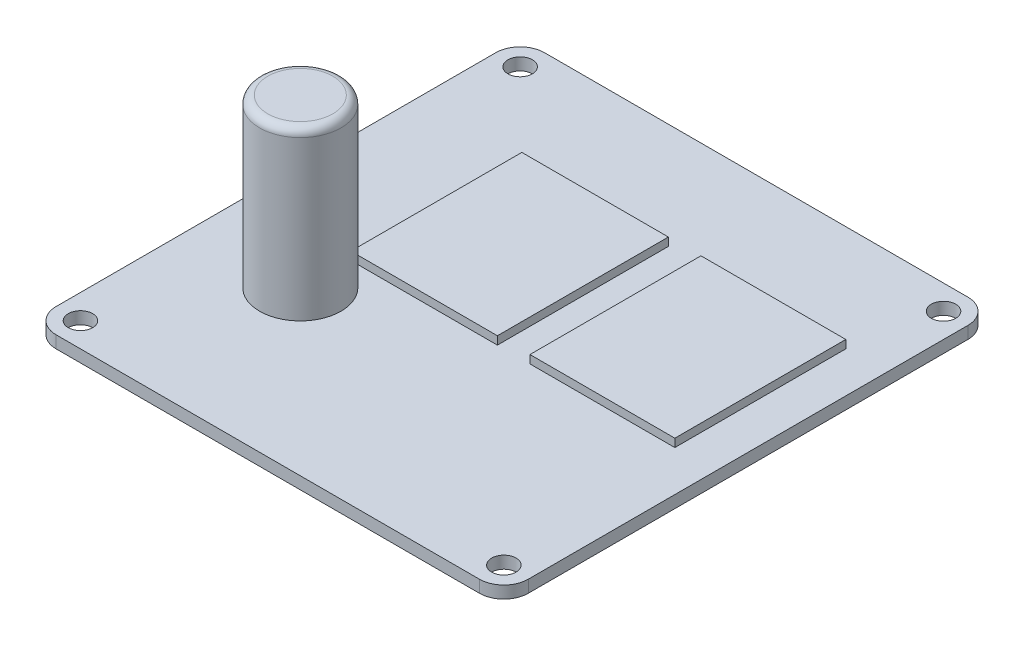
ISO-10303-21;
HEADER;
FILE_DESCRIPTION(('STEP AP214'),'2;1');
FILE_NAME('part.step','',(''),(''),'','','');
FILE_SCHEMA(('AUTOMOTIVE_DESIGN { 1 0 10303 214 1 1 1 1 }'));
ENDSEC;
DATA;
#1=APPLICATION_CONTEXT('core data for automotive mechanical design processes');
#2=APPLICATION_PROTOCOL_DEFINITION('international standard','automotive_design',2000,#1);
#3=PRODUCT_CONTEXT('',#1,'mechanical');
#4=PRODUCT('Part','Part','',(#3));
#5=PRODUCT_RELATED_PRODUCT_CATEGORY('part','',(#4));
#6=PRODUCT_DEFINITION_FORMATION('','',#4);
#7=PRODUCT_DEFINITION_CONTEXT('part definition',#1,'design');
#8=PRODUCT_DEFINITION('design','',#6,#7);
#9=PRODUCT_DEFINITION_SHAPE('','',#8);
#10=(LENGTH_UNIT() NAMED_UNIT(*) SI_UNIT(.MILLI.,.METRE.));
#11=(NAMED_UNIT(*) PLANE_ANGLE_UNIT() SI_UNIT($,.RADIAN.));
#12=(NAMED_UNIT(*) SI_UNIT($,.STERADIAN.) SOLID_ANGLE_UNIT());
#13=UNCERTAINTY_MEASURE_WITH_UNIT(LENGTH_MEASURE(1.E-05),#10,'distance_accuracy_value','');
#14=(GEOMETRIC_REPRESENTATION_CONTEXT(3) GLOBAL_UNCERTAINTY_ASSIGNED_CONTEXT((#13)) GLOBAL_UNIT_ASSIGNED_CONTEXT((#10,
#11,#12)) REPRESENTATION_CONTEXT('',''));
#15=CARTESIAN_POINT('',(0.,0.,0.));
#16=DIRECTION('',(0.,0.,1.));
#17=DIRECTION('',(1.,0.,0.));
#18=AXIS2_PLACEMENT_3D('',#15,#16,#17);
#19=CARTESIAN_POINT('',(-26.,0.,-27.));
#20=DIRECTION('',(0.,1.,0.));
#21=DIRECTION('',(0.,0.,1.));
#22=AXIS2_PLACEMENT_3D('',#19,#20,#21);
#23=PLANE('',#22);
#24=CARTESIAN_POINT('',(26.,0.,-27.));
#25=DIRECTION('',(0.,1.,0.));
#26=DIRECTION('',(0.,0.,-1.));
#27=AXIS2_PLACEMENT_3D('',#24,#25,#26);
#28=CIRCLE('',#27,1.5);
#29=CARTESIAN_POINT('',(26.,0.,-28.5));
#30=VERTEX_POINT('',#29);
#31=EDGE_CURVE('E379',#30,#30,#28,.T.);
#32=ORIENTED_EDGE('',*,*,#31,.F.);
#33=EDGE_LOOP('',(#32));
#34=FACE_BOUND('',#33,.T.);
#35=CARTESIAN_POINT('',(-26.,0.,27.));
#36=DIRECTION('',(0.,1.,0.));
#37=DIRECTION('',(0.,0.,-1.));
#38=AXIS2_PLACEMENT_3D('',#35,#36,#37);
#39=CIRCLE('',#38,1.5);
#40=CARTESIAN_POINT('',(-26.,0.,25.5));
#41=VERTEX_POINT('',#40);
#42=EDGE_CURVE('E380',#41,#41,#39,.T.);
#43=ORIENTED_EDGE('',*,*,#42,.F.);
#44=EDGE_LOOP('',(#43));
#45=FACE_BOUND('',#44,.T.);
#46=CARTESIAN_POINT('',(26.,0.,27.));
#47=DIRECTION('',(0.,1.,0.));
#48=DIRECTION('',(0.,0.,1.));
#49=AXIS2_PLACEMENT_3D('',#46,#47,#48);
#50=CIRCLE('',#49,1.5);
#51=CARTESIAN_POINT('',(26.,0.,28.5));
#52=VERTEX_POINT('',#51);
#53=EDGE_CURVE('E390',#52,#52,#50,.T.);
#54=ORIENTED_EDGE('',*,*,#53,.F.);
#55=EDGE_LOOP('',(#54));
#56=FACE_BOUND('',#55,.T.);
#57=CARTESIAN_POINT('',(-26.,0.,-27.));
#58=DIRECTION('',(0.,1.,0.));
#59=DIRECTION('',(0.,0.,1.));
#60=AXIS2_PLACEMENT_3D('',#57,#58,#59);
#61=CIRCLE('',#60,1.5);
#62=CARTESIAN_POINT('',(-26.,0.,-25.5));
#63=VERTEX_POINT('',#62);
#64=EDGE_CURVE('E372',#63,#63,#61,.T.);
#65=ORIENTED_EDGE('',*,*,#64,.F.);
#66=EDGE_LOOP('',(#65));
#67=FACE_BOUND('',#66,.T.);
#68=CARTESIAN_POINT('',(-16.,0.,10.));
#69=DIRECTION('',(0.,1.,0.));
#70=DIRECTION('',(0.,0.,1.));
#71=AXIS2_PLACEMENT_3D('',#68,#69,#70);
#72=CIRCLE('',#71,5.);
#73=CARTESIAN_POINT('',(-16.,0.,15.));
#74=VERTEX_POINT('',#73);
#75=EDGE_CURVE('E359',#74,#74,#72,.T.);
#76=ORIENTED_EDGE('',*,*,#75,.F.);
#77=EDGE_LOOP('',(#76));
#78=FACE_BOUND('',#77,.T.);
#79=CARTESIAN_POINT('',(-26.,0.,-27.));
#80=DIRECTION('',(0.,1.,0.));
#81=DIRECTION('',(0.,0.,1.));
#82=AXIS2_PLACEMENT_3D('',#79,#80,#81);
#83=CIRCLE('',#82,3.);
#84=CARTESIAN_POINT('',(-26.,0.,-30.));
#85=VERTEX_POINT('',#84);
#86=CARTESIAN_POINT('',(-29.,0.,-27.));
#87=VERTEX_POINT('',#86);
#88=EDGE_CURVE('E203',#85,#87,#83,.T.);
#89=ORIENTED_EDGE('',*,*,#88,.T.);
#90=DIRECTION('',(0.,0.,1.));
#91=VECTOR('',#90,1.);
#92=CARTESIAN_POINT('',(-29.,0.,-27.));
#93=LINE('',#92,#91);
#94=CARTESIAN_POINT('',(-29.,0.,27.));
#95=VERTEX_POINT('',#94);
#96=EDGE_CURVE('E229',#87,#95,#93,.T.);
#97=ORIENTED_EDGE('',*,*,#96,.T.);
#98=CARTESIAN_POINT('',(-26.,0.,27.));
#99=DIRECTION('',(0.,1.,0.));
#100=DIRECTION('',(0.,0.,1.));
#101=AXIS2_PLACEMENT_3D('',#98,#99,#100);
#102=CIRCLE('',#101,3.);
#103=CARTESIAN_POINT('',(-26.,0.,30.));
#104=VERTEX_POINT('',#103);
#105=EDGE_CURVE('E232',#95,#104,#102,.T.);
#106=ORIENTED_EDGE('',*,*,#105,.T.);
#107=DIRECTION('',(1.,0.,0.));
#108=VECTOR('',#107,1.);
#109=CARTESIAN_POINT('',(-26.,0.,30.));
#110=LINE('',#109,#108);
#111=CARTESIAN_POINT('',(26.,0.,30.));
#112=VERTEX_POINT('',#111);
#113=EDGE_CURVE('E235',#104,#112,#110,.T.);
#114=ORIENTED_EDGE('',*,*,#113,.T.);
#115=CARTESIAN_POINT('',(26.,0.,27.));
#116=DIRECTION('',(0.,1.,0.));
#117=DIRECTION('',(0.,0.,1.));
#118=AXIS2_PLACEMENT_3D('',#115,#116,#117);
#119=CIRCLE('',#118,3.);
#120=CARTESIAN_POINT('',(29.,0.,27.));
#121=VERTEX_POINT('',#120);
#122=EDGE_CURVE('E238',#112,#121,#119,.T.);
#123=ORIENTED_EDGE('',*,*,#122,.T.);
#124=DIRECTION('',(0.,0.,1.));
#125=VECTOR('',#124,1.);
#126=CARTESIAN_POINT('',(29.,0.,-27.));
#127=LINE('',#126,#125);
#128=CARTESIAN_POINT('',(29.,0.,-27.));
#129=VERTEX_POINT('',#128);
#130=EDGE_CURVE('E241',#129,#121,#127,.T.);
#131=ORIENTED_EDGE('',*,*,#130,.F.);
#132=CARTESIAN_POINT('',(26.,0.,-27.));
#133=DIRECTION('',(0.,-1.,0.));
#134=DIRECTION('',(0.,0.,-1.));
#135=AXIS2_PLACEMENT_3D('',#132,#133,#134);
#136=CIRCLE('',#135,3.);
#137=CARTESIAN_POINT('',(26.,0.,-30.));
#138=VERTEX_POINT('',#137);
#139=EDGE_CURVE('E244',#138,#129,#136,.T.);
#140=ORIENTED_EDGE('',*,*,#139,.F.);
#141=DIRECTION('',(1.,0.,0.));
#142=VECTOR('',#141,1.);
#143=CARTESIAN_POINT('',(-26.,0.,-30.));
#144=LINE('',#143,#142);
#145=EDGE_CURVE('E208',#85,#138,#144,.T.);
#146=ORIENTED_EDGE('',*,*,#145,.F.);
#147=EDGE_LOOP('',(#89,#97,#106,#114,#123,#131,#140,#146));
#148=FACE_BOUND('',#147,.T.);
#149=DIRECTION('',(1.,0.,0.));
#150=VECTOR('',#149,1.);
#151=CARTESIAN_POINT('',(6.20725776281332,0.,4.));
#152=LINE('',#151,#150);
#153=CARTESIAN_POINT('',(6.20725776281332,0.,4.));
#154=VERTEX_POINT('',#153);
#155=CARTESIAN_POINT('',(24.,0.,4.));
#156=VERTEX_POINT('',#155);
#157=EDGE_CURVE('E175',#154,#156,#152,.T.);
#158=ORIENTED_EDGE('',*,*,#157,.F.);
#159=DIRECTION('',(0.,0.,1.));
#160=VECTOR('',#159,1.);
#161=CARTESIAN_POINT('',(6.20725776281332,0.,-17.));
#162=LINE('',#161,#160);
#163=CARTESIAN_POINT('',(6.20725776281332,0.,-17.));
#164=VERTEX_POINT('',#163);
#165=EDGE_CURVE('E172',#164,#154,#162,.T.);
#166=ORIENTED_EDGE('',*,*,#165,.F.);
#167=DIRECTION('',(-1.,0.,0.));
#168=VECTOR('',#167,1.);
#169=CARTESIAN_POINT('',(6.20725776281332,0.,-17.));
#170=LINE('',#169,#168);
#171=CARTESIAN_POINT('',(24.,0.,-17.));
#172=VERTEX_POINT('',#171);
#173=EDGE_CURVE('E184',#172,#164,#170,.T.);
#174=ORIENTED_EDGE('',*,*,#173,.F.);
#175=DIRECTION('',(0.,0.,-1.));
#176=VECTOR('',#175,1.);
#177=CARTESIAN_POINT('',(24.,0.,-17.));
#178=LINE('',#177,#176);
#179=EDGE_CURVE('E192',#156,#172,#178,.T.);
#180=ORIENTED_EDGE('',*,*,#179,.F.);
#181=EDGE_LOOP('',(#158,#166,#174,#180));
#182=FACE_BOUND('',#181,.T.);
#183=DIRECTION('',(1.,0.,0.));
#184=VECTOR('',#183,1.);
#185=CARTESIAN_POINT('',(-15.7927422371867,0.,4.));
#186=LINE('',#185,#184);
#187=CARTESIAN_POINT('',(-15.7927422371867,0.,4.));
#188=VERTEX_POINT('',#187);
#189=CARTESIAN_POINT('',(2.20725776281332,0.,4.));
#190=VERTEX_POINT('',#189);
#191=EDGE_CURVE('E354',#188,#190,#186,.T.);
#192=ORIENTED_EDGE('',*,*,#191,.F.);
#193=DIRECTION('',(0.,0.,1.));
#194=VECTOR('',#193,1.);
#195=CARTESIAN_POINT('',(-15.7927422371867,0.,-17.));
#196=LINE('',#195,#194);
#197=CARTESIAN_POINT('',(-15.7927422371867,0.,-17.));
#198=VERTEX_POINT('',#197);
#199=EDGE_CURVE('E170',#198,#188,#196,.T.);
#200=ORIENTED_EDGE('',*,*,#199,.F.);
#201=DIRECTION('',(-1.,0.,0.));
#202=VECTOR('',#201,1.);
#203=CARTESIAN_POINT('',(-15.7927422371867,0.,-17.));
#204=LINE('',#203,#202);
#205=CARTESIAN_POINT('',(2.20725776281332,0.,-17.));
#206=VERTEX_POINT('',#205);
#207=EDGE_CURVE('E166',#206,#198,#204,.T.);
#208=ORIENTED_EDGE('',*,*,#207,.F.);
#209=DIRECTION('',(0.,0.,-1.));
#210=VECTOR('',#209,1.);
#211=CARTESIAN_POINT('',(2.20725776281332,0.,-17.));
#212=LINE('',#211,#210);
#213=EDGE_CURVE('E356',#190,#206,#212,.T.);
#214=ORIENTED_EDGE('',*,*,#213,.F.);
#215=EDGE_LOOP('',(#192,#200,#208,#214));
#216=FACE_BOUND('',#215,.T.);
#217=ADVANCED_FACE('F33',(#34,#45,#56,#67,#78,#148,#182,#216),#23,.T.);
#218=CARTESIAN_POINT('',(-26.,-1.5,-27.));
#219=DIRECTION('',(0.,1.,0.));
#220=DIRECTION('',(0.,0.,1.));
#221=AXIS2_PLACEMENT_3D('',#218,#219,#220);
#222=CYLINDRICAL_SURFACE('',#221,3.);
#223=ORIENTED_EDGE('',*,*,#88,.F.);
#224=DIRECTION('',(0.,1.,0.));
#225=VECTOR('',#224,1.);
#226=CARTESIAN_POINT('',(-26.,-1.5,-30.));
#227=LINE('',#226,#225);
#228=CARTESIAN_POINT('',(-26.,-1.5,-30.));
#229=VERTEX_POINT('',#228);
#230=EDGE_CURVE('E247',#229,#85,#227,.T.);
#231=ORIENTED_EDGE('',*,*,#230,.F.);
#232=CARTESIAN_POINT('',(-26.,-1.5,-27.));
#233=DIRECTION('',(0.,1.,0.));
#234=DIRECTION('',(0.,0.,1.));
#235=AXIS2_PLACEMENT_3D('',#232,#233,#234);
#236=CIRCLE('',#235,3.);
#237=CARTESIAN_POINT('',(-29.,-1.5,-27.));
#238=VERTEX_POINT('',#237);
#239=EDGE_CURVE('E204',#229,#238,#236,.T.);
#240=ORIENTED_EDGE('',*,*,#239,.T.);
#241=DIRECTION('',(0.,1.,0.));
#242=VECTOR('',#241,1.);
#243=CARTESIAN_POINT('',(-29.,-1.5,-27.));
#244=LINE('',#243,#242);
#245=EDGE_CURVE('E226',#238,#87,#244,.T.);
#246=ORIENTED_EDGE('',*,*,#245,.T.);
#247=EDGE_LOOP('',(#223,#231,#240,#246));
#248=FACE_BOUND('',#247,.T.);
#249=ADVANCED_FACE('F282',(#248),#222,.T.);
#250=CARTESIAN_POINT('',(-26.,-1.5,-30.));
#251=DIRECTION('',(0.,0.,1.));
#252=DIRECTION('',(1.,0.,0.));
#253=AXIS2_PLACEMENT_3D('',#250,#251,#252);
#254=PLANE('',#253);
#255=ORIENTED_EDGE('',*,*,#145,.T.);
#256=DIRECTION('',(0.,1.,0.));
#257=VECTOR('',#256,1.);
#258=CARTESIAN_POINT('',(26.,-1.5,-30.));
#259=LINE('',#258,#257);
#260=CARTESIAN_POINT('',(26.,-1.5,-30.));
#261=VERTEX_POINT('',#260);
#262=EDGE_CURVE('E249',#261,#138,#259,.T.);
#263=ORIENTED_EDGE('',*,*,#262,.F.);
#264=DIRECTION('',(1.,0.,0.));
#265=VECTOR('',#264,1.);
#266=CARTESIAN_POINT('',(-26.,-1.5,-30.));
#267=LINE('',#266,#265);
#268=EDGE_CURVE('E224',#229,#261,#267,.T.);
#269=ORIENTED_EDGE('',*,*,#268,.F.);
#270=ORIENTED_EDGE('',*,*,#230,.T.);
#271=EDGE_LOOP('',(#255,#263,#269,#270));
#272=FACE_BOUND('',#271,.T.);
#273=ADVANCED_FACE('F288',(#272),#254,.F.);
#274=CARTESIAN_POINT('',(26.,-1.5,-27.));
#275=DIRECTION('',(0.,1.,0.));
#276=DIRECTION('',(0.,0.,1.));
#277=AXIS2_PLACEMENT_3D('',#274,#275,#276);
#278=CYLINDRICAL_SURFACE('',#277,3.);
#279=ORIENTED_EDGE('',*,*,#139,.T.);
#280=DIRECTION('',(0.,1.,0.));
#281=VECTOR('',#280,1.);
#282=CARTESIAN_POINT('',(29.,-1.5,-27.));
#283=LINE('',#282,#281);
#284=CARTESIAN_POINT('',(29.,-1.5,-27.));
#285=VERTEX_POINT('',#284);
#286=EDGE_CURVE('E252',#285,#129,#283,.T.);
#287=ORIENTED_EDGE('',*,*,#286,.F.);
#288=CARTESIAN_POINT('',(26.,-1.5,-27.));
#289=DIRECTION('',(0.,-1.,0.));
#290=DIRECTION('',(0.,0.,-1.));
#291=AXIS2_PLACEMENT_3D('',#288,#289,#290);
#292=CIRCLE('',#291,3.);
#293=EDGE_CURVE('E222',#261,#285,#292,.T.);
#294=ORIENTED_EDGE('',*,*,#293,.F.);
#295=ORIENTED_EDGE('',*,*,#262,.T.);
#296=EDGE_LOOP('',(#279,#287,#294,#295));
#297=FACE_BOUND('',#296,.T.);
#298=ADVANCED_FACE('F298',(#297),#278,.T.);
#299=CARTESIAN_POINT('',(29.,-1.5,-27.));
#300=DIRECTION('',(-1.,0.,0.));
#301=DIRECTION('',(0.,0.,1.));
#302=AXIS2_PLACEMENT_3D('',#299,#300,#301);
#303=PLANE('',#302);
#304=ORIENTED_EDGE('',*,*,#130,.T.);
#305=DIRECTION('',(0.,1.,0.));
#306=VECTOR('',#305,1.);
#307=CARTESIAN_POINT('',(29.,-1.5,27.));
#308=LINE('',#307,#306);
#309=CARTESIAN_POINT('',(29.,-1.5,27.));
#310=VERTEX_POINT('',#309);
#311=EDGE_CURVE('E255',#310,#121,#308,.T.);
#312=ORIENTED_EDGE('',*,*,#311,.F.);
#313=DIRECTION('',(0.,0.,1.));
#314=VECTOR('',#313,1.);
#315=CARTESIAN_POINT('',(29.,-1.5,-27.));
#316=LINE('',#315,#314);
#317=EDGE_CURVE('E220',#285,#310,#316,.T.);
#318=ORIENTED_EDGE('',*,*,#317,.F.);
#319=ORIENTED_EDGE('',*,*,#286,.T.);
#320=EDGE_LOOP('',(#304,#312,#318,#319));
#321=FACE_BOUND('',#320,.T.);
#322=ADVANCED_FACE('F302',(#321),#303,.F.);
#323=CARTESIAN_POINT('',(26.,-1.5,27.));
#324=DIRECTION('',(0.,1.,0.));
#325=DIRECTION('',(0.,0.,1.));
#326=AXIS2_PLACEMENT_3D('',#323,#324,#325);
#327=CYLINDRICAL_SURFACE('',#326,3.);
#328=ORIENTED_EDGE('',*,*,#122,.F.);
#329=DIRECTION('',(0.,1.,0.));
#330=VECTOR('',#329,1.);
#331=CARTESIAN_POINT('',(26.,-1.5,30.));
#332=LINE('',#331,#330);
#333=CARTESIAN_POINT('',(26.,-1.5,30.));
#334=VERTEX_POINT('',#333);
#335=EDGE_CURVE('E257',#334,#112,#332,.T.);
#336=ORIENTED_EDGE('',*,*,#335,.F.);
#337=CARTESIAN_POINT('',(26.,-1.5,27.));
#338=DIRECTION('',(0.,1.,0.));
#339=DIRECTION('',(0.,0.,1.));
#340=AXIS2_PLACEMENT_3D('',#337,#338,#339);
#341=CIRCLE('',#340,3.);
#342=EDGE_CURVE('E217',#334,#310,#341,.T.);
#343=ORIENTED_EDGE('',*,*,#342,.T.);
#344=ORIENTED_EDGE('',*,*,#311,.T.);
#345=EDGE_LOOP('',(#328,#336,#343,#344));
#346=FACE_BOUND('',#345,.T.);
#347=ADVANCED_FACE('F306',(#346),#327,.T.);
#348=CARTESIAN_POINT('',(-26.,-1.5,30.));
#349=DIRECTION('',(0.,0.,1.));
#350=DIRECTION('',(1.,0.,0.));
#351=AXIS2_PLACEMENT_3D('',#348,#349,#350);
#352=PLANE('',#351);
#353=ORIENTED_EDGE('',*,*,#113,.F.);
#354=DIRECTION('',(0.,1.,0.));
#355=VECTOR('',#354,1.);
#356=CARTESIAN_POINT('',(-26.,-1.5,30.));
#357=LINE('',#356,#355);
#358=CARTESIAN_POINT('',(-26.,-1.5,30.));
#359=VERTEX_POINT('',#358);
#360=EDGE_CURVE('E259',#359,#104,#357,.T.);
#361=ORIENTED_EDGE('',*,*,#360,.F.);
#362=DIRECTION('',(1.,0.,0.));
#363=VECTOR('',#362,1.);
#364=CARTESIAN_POINT('',(-26.,-1.5,30.));
#365=LINE('',#364,#363);
#366=EDGE_CURVE('E214',#359,#334,#365,.T.);
#367=ORIENTED_EDGE('',*,*,#366,.T.);
#368=ORIENTED_EDGE('',*,*,#335,.T.);
#369=EDGE_LOOP('',(#353,#361,#367,#368));
#370=FACE_BOUND('',#369,.T.);
#371=ADVANCED_FACE('F310',(#370),#352,.T.);
#372=CARTESIAN_POINT('',(-26.,-1.5,27.));
#373=DIRECTION('',(0.,1.,0.));
#374=DIRECTION('',(0.,0.,1.));
#375=AXIS2_PLACEMENT_3D('',#372,#373,#374);
#376=CYLINDRICAL_SURFACE('',#375,3.);
#377=ORIENTED_EDGE('',*,*,#105,.F.);
#378=DIRECTION('',(0.,1.,0.));
#379=VECTOR('',#378,1.);
#380=CARTESIAN_POINT('',(-29.,-1.5,27.));
#381=LINE('',#380,#379);
#382=CARTESIAN_POINT('',(-29.,-1.5,27.));
#383=VERTEX_POINT('',#382);
#384=EDGE_CURVE('E261',#383,#95,#381,.T.);
#385=ORIENTED_EDGE('',*,*,#384,.F.);
#386=CARTESIAN_POINT('',(-26.,-1.5,27.));
#387=DIRECTION('',(0.,1.,0.));
#388=DIRECTION('',(0.,0.,1.));
#389=AXIS2_PLACEMENT_3D('',#386,#387,#388);
#390=CIRCLE('',#389,3.);
#391=EDGE_CURVE('E211',#383,#359,#390,.T.);
#392=ORIENTED_EDGE('',*,*,#391,.T.);
#393=ORIENTED_EDGE('',*,*,#360,.T.);
#394=EDGE_LOOP('',(#377,#385,#392,#393));
#395=FACE_BOUND('',#394,.T.);
#396=ADVANCED_FACE('F314',(#395),#376,.T.);
#397=CARTESIAN_POINT('',(-29.,-1.5,-27.));
#398=DIRECTION('',(-1.,0.,0.));
#399=DIRECTION('',(0.,0.,1.));
#400=AXIS2_PLACEMENT_3D('',#397,#398,#399);
#401=PLANE('',#400);
#402=ORIENTED_EDGE('',*,*,#96,.F.);
#403=ORIENTED_EDGE('',*,*,#245,.F.);
#404=DIRECTION('',(0.,0.,1.));
#405=VECTOR('',#404,1.);
#406=CARTESIAN_POINT('',(-29.,-1.5,-27.));
#407=LINE('',#406,#405);
#408=EDGE_CURVE('E207',#238,#383,#407,.T.);
#409=ORIENTED_EDGE('',*,*,#408,.T.);
#410=ORIENTED_EDGE('',*,*,#384,.T.);
#411=EDGE_LOOP('',(#402,#403,#409,#410));
#412=FACE_BOUND('',#411,.T.);
#413=ADVANCED_FACE('F318',(#412),#401,.T.);
#414=CARTESIAN_POINT('',(-26.,-1.5,-27.));
#415=DIRECTION('',(0.,1.,0.));
#416=DIRECTION('',(0.,0.,1.));
#417=AXIS2_PLACEMENT_3D('',#414,#415,#416);
#418=PLANE('',#417);
#419=CARTESIAN_POINT('',(26.,-1.5,-27.));
#420=DIRECTION('',(0.,1.,0.));
#421=DIRECTION('',(0.,0.,1.));
#422=AXIS2_PLACEMENT_3D('',#419,#420,#421);
#423=CIRCLE('',#422,1.5);
#424=CARTESIAN_POINT('',(26.,-1.5,-25.5));
#425=VERTEX_POINT('',#424);
#426=EDGE_CURVE('E375',#425,#425,#423,.F.);
#427=ORIENTED_EDGE('',*,*,#426,.F.);
#428=EDGE_LOOP('',(#427));
#429=FACE_BOUND('',#428,.T.);
#430=CARTESIAN_POINT('',(-26.,-1.5,27.));
#431=DIRECTION('',(0.,1.,0.));
#432=DIRECTION('',(0.,0.,1.));
#433=AXIS2_PLACEMENT_3D('',#430,#431,#432);
#434=CIRCLE('',#433,1.5);
#435=CARTESIAN_POINT('',(-26.,-1.5,28.5));
#436=VERTEX_POINT('',#435);
#437=EDGE_CURVE('E376',#436,#436,#434,.F.);
#438=ORIENTED_EDGE('',*,*,#437,.F.);
#439=EDGE_LOOP('',(#438));
#440=FACE_BOUND('',#439,.T.);
#441=CARTESIAN_POINT('',(26.,-1.5,27.));
#442=DIRECTION('',(0.,1.,0.));
#443=DIRECTION('',(0.,0.,1.));
#444=AXIS2_PLACEMENT_3D('',#441,#442,#443);
#445=CIRCLE('',#444,1.5);
#446=CARTESIAN_POINT('',(26.,-1.5,28.5));
#447=VERTEX_POINT('',#446);
#448=EDGE_CURVE('E383',#447,#447,#445,.F.);
#449=ORIENTED_EDGE('',*,*,#448,.F.);
#450=EDGE_LOOP('',(#449));
#451=FACE_BOUND('',#450,.T.);
#452=CARTESIAN_POINT('',(-26.,-1.5,-27.));
#453=DIRECTION('',(0.,1.,0.));
#454=DIRECTION('',(0.,0.,1.));
#455=AXIS2_PLACEMENT_3D('',#452,#453,#454);
#456=CIRCLE('',#455,1.5);
#457=CARTESIAN_POINT('',(-26.,-1.5,-25.5));
#458=VERTEX_POINT('',#457);
#459=EDGE_CURVE('E369',#458,#458,#456,.F.);
#460=ORIENTED_EDGE('',*,*,#459,.F.);
#461=EDGE_LOOP('',(#460));
#462=FACE_BOUND('',#461,.T.);
#463=ORIENTED_EDGE('',*,*,#239,.F.);
#464=ORIENTED_EDGE('',*,*,#268,.T.);
#465=ORIENTED_EDGE('',*,*,#293,.T.);
#466=ORIENTED_EDGE('',*,*,#317,.T.);
#467=ORIENTED_EDGE('',*,*,#342,.F.);
#468=ORIENTED_EDGE('',*,*,#366,.F.);
#469=ORIENTED_EDGE('',*,*,#391,.F.);
#470=ORIENTED_EDGE('',*,*,#408,.F.);
#471=EDGE_LOOP('',(#463,#464,#465,#466,#467,#468,#469,#470));
#472=FACE_BOUND('',#471,.T.);
#473=ADVANCED_FACE('F294',(#429,#440,#451,#462,#472),#418,.F.);
#474=CARTESIAN_POINT('',(6.20725776281332,1.,-17.));
#475=DIRECTION('',(1.,0.,0.));
#476=DIRECTION('',(0.,0.,-1.));
#477=AXIS2_PLACEMENT_3D('',#474,#475,#476);
#478=PLANE('',#477);
#479=ORIENTED_EDGE('',*,*,#165,.T.);
#480=DIRECTION('',(0.,-1.,0.));
#481=VECTOR('',#480,1.);
#482=CARTESIAN_POINT('',(6.20725776281332,1.,4.));
#483=LINE('',#482,#481);
#484=CARTESIAN_POINT('',(6.20725776281332,1.,4.));
#485=VERTEX_POINT('',#484);
#486=EDGE_CURVE('E201',#485,#154,#483,.T.);
#487=ORIENTED_EDGE('',*,*,#486,.F.);
#488=DIRECTION('',(0.,0.,1.));
#489=VECTOR('',#488,1.);
#490=CARTESIAN_POINT('',(6.20725776281332,1.,-17.));
#491=LINE('',#490,#489);
#492=CARTESIAN_POINT('',(6.20725776281332,1.,-17.));
#493=VERTEX_POINT('',#492);
#494=EDGE_CURVE('E180',#493,#485,#491,.T.);
#495=ORIENTED_EDGE('',*,*,#494,.F.);
#496=DIRECTION('',(0.,-1.,0.));
#497=VECTOR('',#496,1.);
#498=CARTESIAN_POINT('',(6.20725776281332,1.,-17.));
#499=LINE('',#498,#497);
#500=EDGE_CURVE('E189',#493,#164,#499,.T.);
#501=ORIENTED_EDGE('',*,*,#500,.T.);
#502=EDGE_LOOP('',(#479,#487,#495,#501));
#503=FACE_BOUND('',#502,.T.);
#504=ADVANCED_FACE('F325',(#503),#478,.F.);
#505=CARTESIAN_POINT('',(6.20725776281332,1.,4.));
#506=DIRECTION('',(0.,0.,-1.));
#507=DIRECTION('',(-1.,0.,0.));
#508=AXIS2_PLACEMENT_3D('',#505,#506,#507);
#509=PLANE('',#508);
#510=ORIENTED_EDGE('',*,*,#157,.T.);
#511=DIRECTION('',(0.,-1.,0.));
#512=VECTOR('',#511,1.);
#513=CARTESIAN_POINT('',(24.,1.,4.));
#514=LINE('',#513,#512);
#515=CARTESIAN_POINT('',(24.,1.,4.));
#516=VERTEX_POINT('',#515);
#517=EDGE_CURVE('E198',#516,#156,#514,.T.);
#518=ORIENTED_EDGE('',*,*,#517,.F.);
#519=DIRECTION('',(1.,0.,0.));
#520=VECTOR('',#519,1.);
#521=CARTESIAN_POINT('',(6.20725776281332,1.,4.));
#522=LINE('',#521,#520);
#523=EDGE_CURVE('E183',#485,#516,#522,.T.);
#524=ORIENTED_EDGE('',*,*,#523,.F.);
#525=ORIENTED_EDGE('',*,*,#486,.T.);
#526=EDGE_LOOP('',(#510,#518,#524,#525));
#527=FACE_BOUND('',#526,.T.);
#528=ADVANCED_FACE('F430',(#527),#509,.F.);
#529=CARTESIAN_POINT('',(24.,1.,-17.));
#530=DIRECTION('',(-1.,0.,0.));
#531=DIRECTION('',(0.,0.,1.));
#532=AXIS2_PLACEMENT_3D('',#529,#530,#531);
#533=PLANE('',#532);
#534=ORIENTED_EDGE('',*,*,#179,.T.);
#535=DIRECTION('',(0.,-1.,0.));
#536=VECTOR('',#535,1.);
#537=CARTESIAN_POINT('',(24.,1.,-17.));
#538=LINE('',#537,#536);
#539=CARTESIAN_POINT('',(24.,1.,-17.));
#540=VERTEX_POINT('',#539);
#541=EDGE_CURVE('E56',#540,#172,#538,.T.);
#542=ORIENTED_EDGE('',*,*,#541,.F.);
#543=DIRECTION('',(0.,0.,-1.));
#544=VECTOR('',#543,1.);
#545=CARTESIAN_POINT('',(24.,1.,-17.));
#546=LINE('',#545,#544);
#547=EDGE_CURVE('E186',#516,#540,#546,.T.);
#548=ORIENTED_EDGE('',*,*,#547,.F.);
#549=ORIENTED_EDGE('',*,*,#517,.T.);
#550=EDGE_LOOP('',(#534,#542,#548,#549));
#551=FACE_BOUND('',#550,.T.);
#552=ADVANCED_FACE('F427',(#551),#533,.F.);
#553=CARTESIAN_POINT('',(6.20725776281332,1.,-17.));
#554=DIRECTION('',(0.,0.,1.));
#555=DIRECTION('',(1.,0.,0.));
#556=AXIS2_PLACEMENT_3D('',#553,#554,#555);
#557=PLANE('',#556);
#558=ORIENTED_EDGE('',*,*,#173,.T.);
#559=ORIENTED_EDGE('',*,*,#500,.F.);
#560=DIRECTION('',(-1.,0.,0.));
#561=VECTOR('',#560,1.);
#562=CARTESIAN_POINT('',(6.20725776281332,1.,-17.));
#563=LINE('',#562,#561);
#564=EDGE_CURVE('E188',#540,#493,#563,.T.);
#565=ORIENTED_EDGE('',*,*,#564,.F.);
#566=ORIENTED_EDGE('',*,*,#541,.T.);
#567=EDGE_LOOP('',(#558,#559,#565,#566));
#568=FACE_BOUND('',#567,.T.);
#569=ADVANCED_FACE('F423',(#568),#557,.F.);
#570=CARTESIAN_POINT('',(0.,1.,0.));
#571=DIRECTION('',(0.,1.,0.));
#572=DIRECTION('',(0.,0.,1.));
#573=AXIS2_PLACEMENT_3D('',#570,#571,#572);
#574=PLANE('',#573);
#575=ORIENTED_EDGE('',*,*,#494,.T.);
#576=ORIENTED_EDGE('',*,*,#523,.T.);
#577=ORIENTED_EDGE('',*,*,#547,.T.);
#578=ORIENTED_EDGE('',*,*,#564,.T.);
#579=EDGE_LOOP('',(#575,#576,#577,#578));
#580=FACE_BOUND('',#579,.T.);
#581=ADVANCED_FACE('F420',(#580),#574,.T.);
#582=CARTESIAN_POINT('',(-15.7927422371867,1.,-17.));
#583=DIRECTION('',(1.,0.,0.));
#584=DIRECTION('',(0.,0.,-1.));
#585=AXIS2_PLACEMENT_3D('',#582,#583,#584);
#586=PLANE('',#585);
#587=ORIENTED_EDGE('',*,*,#199,.T.);
#588=DIRECTION('',(0.,-1.,0.));
#589=VECTOR('',#588,1.);
#590=CARTESIAN_POINT('',(-15.7927422371867,1.,4.));
#591=LINE('',#590,#589);
#592=CARTESIAN_POINT('',(-15.7927422371867,1.,4.));
#593=VERTEX_POINT('',#592);
#594=EDGE_CURVE('E151',#593,#188,#591,.T.);
#595=ORIENTED_EDGE('',*,*,#594,.F.);
#596=DIRECTION('',(0.,0.,1.));
#597=VECTOR('',#596,1.);
#598=CARTESIAN_POINT('',(-15.7927422371867,1.,-17.));
#599=LINE('',#598,#597);
#600=CARTESIAN_POINT('',(-15.7927422371867,1.,-17.));
#601=VERTEX_POINT('',#600);
#602=EDGE_CURVE('E158',#601,#593,#599,.T.);
#603=ORIENTED_EDGE('',*,*,#602,.F.);
#604=DIRECTION('',(0.,-1.,0.));
#605=VECTOR('',#604,1.);
#606=CARTESIAN_POINT('',(-15.7927422371867,1.,-17.));
#607=LINE('',#606,#605);
#608=EDGE_CURVE('E364',#601,#198,#607,.T.);
#609=ORIENTED_EDGE('',*,*,#608,.T.);
#610=EDGE_LOOP('',(#587,#595,#603,#609));
#611=FACE_BOUND('',#610,.T.);
#612=ADVANCED_FACE('F168',(#611),#586,.F.);
#613=CARTESIAN_POINT('',(-15.7927422371867,1.,4.));
#614=DIRECTION('',(0.,0.,-1.));
#615=DIRECTION('',(-1.,0.,0.));
#616=AXIS2_PLACEMENT_3D('',#613,#614,#615);
#617=PLANE('',#616);
#618=ORIENTED_EDGE('',*,*,#191,.T.);
#619=DIRECTION('',(0.,-1.,0.));
#620=VECTOR('',#619,1.);
#621=CARTESIAN_POINT('',(2.20725776281332,1.,4.));
#622=LINE('',#621,#620);
#623=CARTESIAN_POINT('',(2.20725776281332,1.,4.));
#624=VERTEX_POINT('',#623);
#625=EDGE_CURVE('E154',#624,#190,#622,.T.);
#626=ORIENTED_EDGE('',*,*,#625,.F.);
#627=DIRECTION('',(1.,0.,0.));
#628=VECTOR('',#627,1.);
#629=CARTESIAN_POINT('',(-15.7927422371867,1.,4.));
#630=LINE('',#629,#628);
#631=EDGE_CURVE('E147',#593,#624,#630,.T.);
#632=ORIENTED_EDGE('',*,*,#631,.F.);
#633=ORIENTED_EDGE('',*,*,#594,.T.);
#634=EDGE_LOOP('',(#618,#626,#632,#633));
#635=FACE_BOUND('',#634,.T.);
#636=ADVANCED_FACE('F149',(#635),#617,.F.);
#637=CARTESIAN_POINT('',(2.20725776281332,1.,-17.));
#638=DIRECTION('',(-1.,0.,0.));
#639=DIRECTION('',(0.,0.,1.));
#640=AXIS2_PLACEMENT_3D('',#637,#638,#639);
#641=PLANE('',#640);
#642=ORIENTED_EDGE('',*,*,#213,.T.);
#643=DIRECTION('',(0.,-1.,0.));
#644=VECTOR('',#643,1.);
#645=CARTESIAN_POINT('',(2.20725776281332,1.,-17.));
#646=LINE('',#645,#644);
#647=CARTESIAN_POINT('',(2.20725776281332,1.,-17.));
#648=VERTEX_POINT('',#647);
#649=EDGE_CURVE('E48',#648,#206,#646,.T.);
#650=ORIENTED_EDGE('',*,*,#649,.F.);
#651=DIRECTION('',(0.,0.,-1.));
#652=VECTOR('',#651,1.);
#653=CARTESIAN_POINT('',(2.20725776281332,1.,-17.));
#654=LINE('',#653,#652);
#655=EDGE_CURVE('E157',#624,#648,#654,.T.);
#656=ORIENTED_EDGE('',*,*,#655,.F.);
#657=ORIENTED_EDGE('',*,*,#625,.T.);
#658=EDGE_LOOP('',(#642,#650,#656,#657));
#659=FACE_BOUND('',#658,.T.);
#660=ADVANCED_FACE('F412',(#659),#641,.F.);
#661=CARTESIAN_POINT('',(-15.7927422371867,1.,-17.));
#662=DIRECTION('',(0.,0.,1.));
#663=DIRECTION('',(1.,0.,0.));
#664=AXIS2_PLACEMENT_3D('',#661,#662,#663);
#665=PLANE('',#664);
#666=ORIENTED_EDGE('',*,*,#207,.T.);
#667=ORIENTED_EDGE('',*,*,#608,.F.);
#668=DIRECTION('',(-1.,0.,0.));
#669=VECTOR('',#668,1.);
#670=CARTESIAN_POINT('',(-15.7927422371867,1.,-17.));
#671=LINE('',#670,#669);
#672=EDGE_CURVE('E162',#648,#601,#671,.T.);
#673=ORIENTED_EDGE('',*,*,#672,.F.);
#674=ORIENTED_EDGE('',*,*,#649,.T.);
#675=EDGE_LOOP('',(#666,#667,#673,#674));
#676=FACE_BOUND('',#675,.T.);
#677=ADVANCED_FACE('F407',(#676),#665,.F.);
#678=CARTESIAN_POINT('',(0.,1.,0.));
#679=DIRECTION('',(0.,1.,0.));
#680=DIRECTION('',(0.,0.,1.));
#681=AXIS2_PLACEMENT_3D('',#678,#679,#680);
#682=PLANE('',#681);
#683=ORIENTED_EDGE('',*,*,#602,.T.);
#684=ORIENTED_EDGE('',*,*,#631,.T.);
#685=ORIENTED_EDGE('',*,*,#655,.T.);
#686=ORIENTED_EDGE('',*,*,#672,.T.);
#687=EDGE_LOOP('',(#683,#684,#685,#686));
#688=FACE_BOUND('',#687,.T.);
#689=ADVANCED_FACE('F161',(#688),#682,.T.);
#690=CARTESIAN_POINT('',(-16.,20.5,10.));
#691=DIRECTION('',(0.,-1.,0.));
#692=DIRECTION('',(0.,0.,-1.));
#693=AXIS2_PLACEMENT_3D('',#690,#691,#692);
#694=CYLINDRICAL_SURFACE('',#693,5.);
#695=CARTESIAN_POINT('',(-16.,19.5,10.));
#696=DIRECTION('',(0.,1.,0.));
#697=DIRECTION('',(0.,0.,1.));
#698=AXIS2_PLACEMENT_3D('',#695,#696,#697);
#699=CIRCLE('',#698,5.);
#700=CARTESIAN_POINT('',(-16.,19.5,15.));
#701=VERTEX_POINT('',#700);
#702=EDGE_CURVE('E11',#701,#701,#699,.F.);
#703=ORIENTED_EDGE('',*,*,#702,.T.);
#704=EDGE_LOOP('',(#703));
#705=FACE_BOUND('',#704,.T.);
#706=ORIENTED_EDGE('',*,*,#75,.T.);
#707=EDGE_LOOP('',(#706));
#708=FACE_BOUND('',#707,.T.);
#709=ADVANCED_FACE('F278',(#705,#708),#694,.T.);
#710=CARTESIAN_POINT('',(-16.,20.5,10.));
#711=DIRECTION('',(0.,1.,0.));
#712=DIRECTION('',(0.,0.,1.));
#713=AXIS2_PLACEMENT_3D('',#710,#711,#712);
#714=PLANE('',#713);
#715=CARTESIAN_POINT('',(-16.,20.5,10.));
#716=DIRECTION('',(0.,1.,0.));
#717=DIRECTION('',(0.,0.,1.));
#718=AXIS2_PLACEMENT_3D('',#715,#716,#717);
#719=CIRCLE('',#718,4.);
#720=CARTESIAN_POINT('',(-16.,20.5,14.));
#721=VERTEX_POINT('',#720);
#722=EDGE_CURVE('E41',#721,#721,#719,.T.);
#723=ORIENTED_EDGE('',*,*,#722,.T.);
#724=EDGE_LOOP('',(#723));
#725=FACE_BOUND('',#724,.T.);
#726=ADVANCED_FACE('F266',(#725),#714,.T.);
#727=CARTESIAN_POINT('',(-16.,19.5,10.));
#728=DIRECTION('',(0.,1.,0.));
#729=DIRECTION('',(0.,0.,1.));
#730=AXIS2_PLACEMENT_3D('',#727,#728,#729);
#731=TOROIDAL_SURFACE('',#730,4.,1.);
#732=ORIENTED_EDGE('',*,*,#702,.F.);
#733=EDGE_LOOP('',(#732));
#734=FACE_BOUND('',#733,.T.);
#735=ORIENTED_EDGE('',*,*,#722,.F.);
#736=EDGE_LOOP('',(#735));
#737=FACE_BOUND('',#736,.T.);
#738=ADVANCED_FACE('F35',(#734,#737),#731,.T.);
#739=CARTESIAN_POINT('',(-26.,-1.501,-27.));
#740=DIRECTION('',(0.,1.,0.));
#741=DIRECTION('',(0.,0.,1.));
#742=AXIS2_PLACEMENT_3D('',#739,#740,#741);
#743=CYLINDRICAL_SURFACE('',#742,1.5);
#744=ORIENTED_EDGE('',*,*,#64,.T.);
#745=EDGE_LOOP('',(#744));
#746=FACE_BOUND('',#745,.T.);
#747=ORIENTED_EDGE('',*,*,#459,.T.);
#748=EDGE_LOOP('',(#747));
#749=FACE_BOUND('',#748,.T.);
#750=ADVANCED_FACE('F269',(#746,#749),#743,.F.);
#751=CARTESIAN_POINT('',(26.,-1.501,27.));
#752=DIRECTION('',(0.,1.,0.));
#753=DIRECTION('',(0.,0.,1.));
#754=AXIS2_PLACEMENT_3D('',#751,#752,#753);
#755=CYLINDRICAL_SURFACE('',#754,1.5);
#756=ORIENTED_EDGE('',*,*,#53,.T.);
#757=EDGE_LOOP('',(#756));
#758=FACE_BOUND('',#757,.T.);
#759=ORIENTED_EDGE('',*,*,#448,.T.);
#760=EDGE_LOOP('',(#759));
#761=FACE_BOUND('',#760,.T.);
#762=ADVANCED_FACE('F275',(#758,#761),#755,.F.);
#763=CARTESIAN_POINT('',(-26.,-1.501,27.));
#764=DIRECTION('',(0.,1.,0.));
#765=DIRECTION('',(0.,0.,1.));
#766=AXIS2_PLACEMENT_3D('',#763,#764,#765);
#767=CYLINDRICAL_SURFACE('',#766,1.5);
#768=ORIENTED_EDGE('',*,*,#42,.T.);
#769=EDGE_LOOP('',(#768));
#770=FACE_BOUND('',#769,.T.);
#771=ORIENTED_EDGE('',*,*,#437,.T.);
#772=EDGE_LOOP('',(#771));
#773=FACE_BOUND('',#772,.T.);
#774=ADVANCED_FACE('F520',(#770,#773),#767,.F.);
#775=CARTESIAN_POINT('',(26.,-1.501,-27.));
#776=DIRECTION('',(0.,1.,0.));
#777=DIRECTION('',(0.,0.,1.));
#778=AXIS2_PLACEMENT_3D('',#775,#776,#777);
#779=CYLINDRICAL_SURFACE('',#778,1.5);
#780=ORIENTED_EDGE('',*,*,#31,.T.);
#781=EDGE_LOOP('',(#780));
#782=FACE_BOUND('',#781,.T.);
#783=ORIENTED_EDGE('',*,*,#426,.T.);
#784=EDGE_LOOP('',(#783));
#785=FACE_BOUND('',#784,.T.);
#786=ADVANCED_FACE('F529',(#782,#785),#779,.F.);
#787=CLOSED_SHELL('',(#217,#249,#273,#298,#322,#347,#371,#396,#413,#473,#504,#528,#552,#569,
#581,#612,#636,#660,#677,#689,#709,#726,#738,#750,#762,#774,#786));
#788=MANIFOLD_SOLID_BREP('B2',#787);
#789=ADVANCED_BREP_SHAPE_REPRESENTATION('',(#18,#788),#14);
#790=SHAPE_DEFINITION_REPRESENTATION(#9,#789);
ENDSEC;
END-ISO-10303-21;
